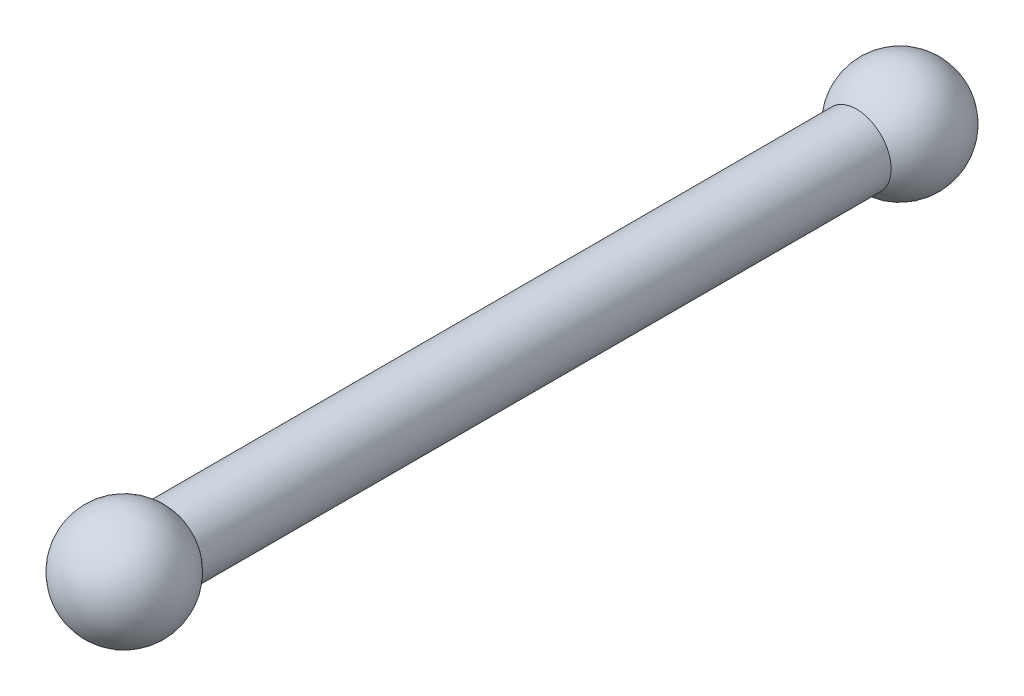
ISO-10303-21;
HEADER;
FILE_DESCRIPTION(('STEP AP214'),'2;1');
FILE_NAME('part.step','',(''),(''),'','','');
FILE_SCHEMA(('AUTOMOTIVE_DESIGN { 1 0 10303 214 1 1 1 1 }'));
ENDSEC;
DATA;
#1=APPLICATION_CONTEXT('core data for automotive mechanical design processes');
#2=APPLICATION_PROTOCOL_DEFINITION('international standard','automotive_design',2000,#1);
#3=PRODUCT_CONTEXT('',#1,'mechanical');
#4=PRODUCT('Part','Part','',(#3));
#5=PRODUCT_RELATED_PRODUCT_CATEGORY('part','',(#4));
#6=PRODUCT_DEFINITION_FORMATION('','',#4);
#7=PRODUCT_DEFINITION_CONTEXT('part definition',#1,'design');
#8=PRODUCT_DEFINITION('design','',#6,#7);
#9=PRODUCT_DEFINITION_SHAPE('','',#8);
#10=(LENGTH_UNIT() NAMED_UNIT(*) SI_UNIT(.MILLI.,.METRE.));
#11=(NAMED_UNIT(*) PLANE_ANGLE_UNIT() SI_UNIT($,.RADIAN.));
#12=(NAMED_UNIT(*) SI_UNIT($,.STERADIAN.) SOLID_ANGLE_UNIT());
#13=UNCERTAINTY_MEASURE_WITH_UNIT(LENGTH_MEASURE(1.E-05),#10,'distance_accuracy_value','');
#14=(GEOMETRIC_REPRESENTATION_CONTEXT(3) GLOBAL_UNCERTAINTY_ASSIGNED_CONTEXT((#13)) GLOBAL_UNIT_ASSIGNED_CONTEXT((#10,
#11,#12)) REPRESENTATION_CONTEXT('',''));
#15=CARTESIAN_POINT('',(0.,0.,0.));
#16=DIRECTION('',(0.,0.,1.));
#17=DIRECTION('',(1.,0.,0.));
#18=AXIS2_PLACEMENT_3D('',#15,#16,#17);
#19=CARTESIAN_POINT('',(0.,0.,-177.8));
#20=DIRECTION('',(0.,0.,1.));
#21=DIRECTION('',(0.,1.,0.));
#22=AXIS2_PLACEMENT_3D('',#19,#20,#21);
#23=SPHERICAL_SURFACE('',#22,12.7);
#24=CARTESIAN_POINT('',(0.,0.,-167.886065677543));
#25=DIRECTION('',(0.,0.,1.));
#26=DIRECTION('',(1.,0.,0.));
#27=AXIS2_PLACEMENT_3D('',#24,#25,#26);
#28=CIRCLE('',#27,7.9375);
#29=CARTESIAN_POINT('',(7.9375,0.,-167.886065677543));
#30=VERTEX_POINT('',#29);
#31=EDGE_CURVE('E10',#30,#30,#28,.T.);
#32=ORIENTED_EDGE('',*,*,#31,.F.);
#33=EDGE_LOOP('',(#32));
#34=FACE_BOUND('',#33,.T.);
#35=ADVANCED_FACE('F36',(#34),#23,.T.);
#36=CARTESIAN_POINT('',(0.,0.,12.7));
#37=DIRECTION('',(0.,0.,1.));
#38=DIRECTION('',(1.,0.,0.));
#39=AXIS2_PLACEMENT_3D('',#36,#37,#38);
#40=CYLINDRICAL_SURFACE('',#39,7.9375);
#41=CARTESIAN_POINT('',(0.,0.,-9.91393432245746));
#42=DIRECTION('',(0.,0.,1.));
#43=DIRECTION('',(1.,0.,0.));
#44=AXIS2_PLACEMENT_3D('',#41,#42,#43);
#45=CIRCLE('',#44,7.9375);
#46=CARTESIAN_POINT('',(7.9375,0.,-9.91393432245746));
#47=VERTEX_POINT('',#46);
#48=EDGE_CURVE('E44',#47,#47,#45,.T.);
#49=ORIENTED_EDGE('',*,*,#48,.F.);
#50=EDGE_LOOP('',(#49));
#51=FACE_BOUND('',#50,.T.);
#52=ORIENTED_EDGE('',*,*,#31,.T.);
#53=EDGE_LOOP('',(#52));
#54=FACE_BOUND('',#53,.T.);
#55=ADVANCED_FACE('F79',(#51,#54),#40,.T.);
#56=CARTESIAN_POINT('',(0.,0.,0.));
#57=DIRECTION('',(0.,0.,1.));
#58=DIRECTION('',(0.,1.,0.));
#59=AXIS2_PLACEMENT_3D('',#56,#57,#58);
#60=SPHERICAL_SURFACE('',#59,12.7);
#61=ORIENTED_EDGE('',*,*,#48,.T.);
#62=EDGE_LOOP('',(#61));
#63=FACE_BOUND('',#62,.T.);
#64=ADVANCED_FACE('F78',(#63),#60,.T.);
#65=CLOSED_SHELL('',(#35,#55,#64));
#66=CARTESIAN_POINT('',(0.,0.,0.));
#67=DIRECTION('',(0.,0.,1.));
#68=DIRECTION('',(0.,1.,0.));
#69=AXIS2_PLACEMENT_3D('',#66,#67,#68);
#70=SPHERICAL_SURFACE('',#69,12.7);
#71=CARTESIAN_POINT('',(0.,0.,-10.9317347895931));
#72=DIRECTION('',(0.,0.,1.));
#73=DIRECTION('',(1.,0.,0.));
#74=AXIS2_PLACEMENT_3D('',#71,#72,#73);
#75=CIRCLE('',#74,6.4643);
#76=CARTESIAN_POINT('',(6.4643,0.,-10.9317347895931));
#77=VERTEX_POINT('',#76);
#78=EDGE_CURVE('E49',#77,#77,#75,.T.);
#79=ORIENTED_EDGE('',*,*,#78,.F.);
#80=EDGE_LOOP('',(#79));
#81=FACE_BOUND('',#80,.T.);
#82=ADVANCED_FACE('F66',(#81),#70,.T.);
#83=CARTESIAN_POINT('',(0.,0.,12.7));
#84=DIRECTION('',(0.,0.,1.));
#85=DIRECTION('',(1.,0.,0.));
#86=AXIS2_PLACEMENT_3D('',#83,#84,#85);
#87=CYLINDRICAL_SURFACE('',#86,6.4643);
#88=CARTESIAN_POINT('',(0.,0.,-166.868265210407));
#89=DIRECTION('',(0.,0.,1.));
#90=DIRECTION('',(1.,0.,0.));
#91=AXIS2_PLACEMENT_3D('',#88,#89,#90);
#92=CIRCLE('',#91,6.4643);
#93=CARTESIAN_POINT('',(6.4643,0.,-166.868265210407));
#94=VERTEX_POINT('',#93);
#95=EDGE_CURVE('E54',#94,#94,#92,.T.);
#96=ORIENTED_EDGE('',*,*,#95,.F.);
#97=EDGE_LOOP('',(#96));
#98=FACE_BOUND('',#97,.T.);
#99=ORIENTED_EDGE('',*,*,#78,.T.);
#100=EDGE_LOOP('',(#99));
#101=FACE_BOUND('',#100,.T.);
#102=ADVANCED_FACE('F63',(#98,#101),#87,.F.);
#103=CARTESIAN_POINT('',(0.,0.,-177.8));
#104=DIRECTION('',(0.,0.,1.));
#105=DIRECTION('',(0.,1.,0.));
#106=AXIS2_PLACEMENT_3D('',#103,#104,#105);
#107=SPHERICAL_SURFACE('',#106,12.7);
#108=ORIENTED_EDGE('',*,*,#95,.T.);
#109=EDGE_LOOP('',(#108));
#110=FACE_BOUND('',#109,.T.);
#111=ADVANCED_FACE('F61',(#110),#107,.T.);
#112=CLOSED_SHELL('',(#82,#102,#111));
#113=ORIENTED_CLOSED_SHELL('',*,#112,.T.);
#114=BREP_WITH_VOIDS('B2',#65,(#113));
#115=ADVANCED_BREP_SHAPE_REPRESENTATION('',(#18,#114),#14);
#116=SHAPE_DEFINITION_REPRESENTATION(#9,#115);
ENDSEC;
END-ISO-10303-21;
